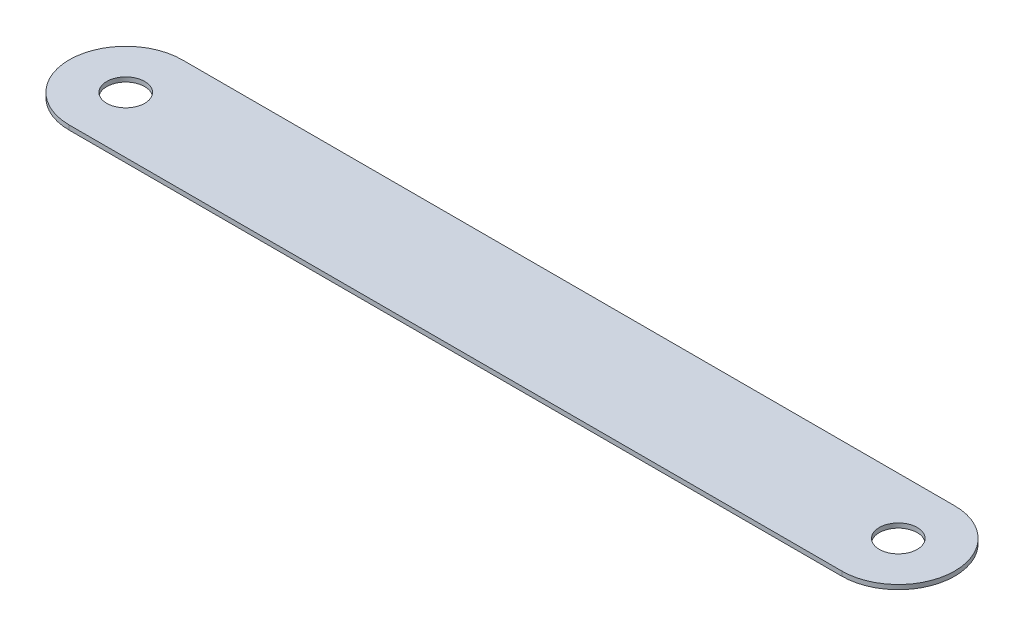
ISO-10303-21;
HEADER;
FILE_DESCRIPTION(('STEP AP214'),'2;1');
FILE_NAME('part.step','',(''),(''),'','','');
FILE_SCHEMA(('AUTOMOTIVE_DESIGN { 1 0 10303 214 1 1 1 1 }'));
ENDSEC;
DATA;
#1=APPLICATION_CONTEXT('core data for automotive mechanical design processes');
#2=APPLICATION_PROTOCOL_DEFINITION('international standard','automotive_design',2000,#1);
#3=PRODUCT_CONTEXT('',#1,'mechanical');
#4=PRODUCT('Part','Part','',(#3));
#5=PRODUCT_RELATED_PRODUCT_CATEGORY('part','',(#4));
#6=PRODUCT_DEFINITION_FORMATION('','',#4);
#7=PRODUCT_DEFINITION_CONTEXT('part definition',#1,'design');
#8=PRODUCT_DEFINITION('design','',#6,#7);
#9=PRODUCT_DEFINITION_SHAPE('','',#8);
#10=(LENGTH_UNIT() NAMED_UNIT(*) SI_UNIT(.MILLI.,.METRE.));
#11=(NAMED_UNIT(*) PLANE_ANGLE_UNIT() SI_UNIT($,.RADIAN.));
#12=(NAMED_UNIT(*) SI_UNIT($,.STERADIAN.) SOLID_ANGLE_UNIT());
#13=UNCERTAINTY_MEASURE_WITH_UNIT(LENGTH_MEASURE(1.E-05),#10,'distance_accuracy_value','');
#14=(GEOMETRIC_REPRESENTATION_CONTEXT(3) GLOBAL_UNCERTAINTY_ASSIGNED_CONTEXT((#13)) GLOBAL_UNIT_ASSIGNED_CONTEXT((#10,
#11,#12)) REPRESENTATION_CONTEXT('',''));
#15=CARTESIAN_POINT('',(0.,0.,0.));
#16=DIRECTION('',(0.,0.,1.));
#17=DIRECTION('',(1.,0.,0.));
#18=AXIS2_PLACEMENT_3D('',#15,#16,#17);
#19=CARTESIAN_POINT('',(-42.75,0.5,0.));
#20=DIRECTION('',(0.,1.,0.));
#21=DIRECTION('',(0.,0.,1.));
#22=AXIS2_PLACEMENT_3D('',#19,#20,#21);
#23=PLANE('',#22);
#24=CARTESIAN_POINT('',(-42.75,0.5,0.));
#25=DIRECTION('',(0.,1.,0.));
#26=DIRECTION('',(0.,0.,1.));
#27=AXIS2_PLACEMENT_3D('',#24,#25,#26);
#28=CIRCLE('',#27,2.1);
#29=CARTESIAN_POINT('',(-42.75,0.5,2.1));
#30=VERTEX_POINT('',#29);
#31=EDGE_CURVE('E106',#30,#30,#28,.T.);
#32=ORIENTED_EDGE('',*,*,#31,.F.);
#33=EDGE_LOOP('',(#32));
#34=FACE_BOUND('',#33,.T.);
#35=CARTESIAN_POINT('',(-42.75,0.5,0.));
#36=DIRECTION('',(0.,1.,0.));
#37=DIRECTION('',(0.,0.,1.));
#38=AXIS2_PLACEMENT_3D('',#35,#36,#37);
#39=CIRCLE('',#38,6.25000000000001);
#40=CARTESIAN_POINT('',(-42.75,0.5,-6.25000000000001));
#41=VERTEX_POINT('',#40);
#42=CARTESIAN_POINT('',(-42.75,0.5,6.25000000000001));
#43=VERTEX_POINT('',#42);
#44=EDGE_CURVE('E91',#41,#43,#39,.T.);
#45=ORIENTED_EDGE('',*,*,#44,.T.);
#46=DIRECTION('',(1.,0.,0.));
#47=VECTOR('',#46,1.);
#48=CARTESIAN_POINT('',(-42.75,0.5,6.25000000000001));
#49=LINE('',#48,#47);
#50=CARTESIAN_POINT('',(42.75,0.5,6.25));
#51=VERTEX_POINT('',#50);
#52=EDGE_CURVE('E86',#43,#51,#49,.T.);
#53=ORIENTED_EDGE('',*,*,#52,.T.);
#54=CARTESIAN_POINT('',(42.75,0.5,0.));
#55=DIRECTION('',(0.,1.,0.));
#56=DIRECTION('',(0.,0.,1.));
#57=AXIS2_PLACEMENT_3D('',#54,#55,#56);
#58=CIRCLE('',#57,6.25000000000001);
#59=CARTESIAN_POINT('',(42.75,0.5,-6.25000000000001));
#60=VERTEX_POINT('',#59);
#61=EDGE_CURVE('E89',#51,#60,#58,.T.);
#62=ORIENTED_EDGE('',*,*,#61,.T.);
#63=DIRECTION('',(-1.,0.,0.));
#64=VECTOR('',#63,1.);
#65=CARTESIAN_POINT('',(-42.75,0.5,-6.25000000000001));
#66=LINE('',#65,#64);
#67=EDGE_CURVE('E56',#60,#41,#66,.T.);
#68=ORIENTED_EDGE('',*,*,#67,.T.);
#69=EDGE_LOOP('',(#45,#53,#62,#68));
#70=FACE_BOUND('',#69,.T.);
#71=CARTESIAN_POINT('',(42.75,0.5,0.));
#72=DIRECTION('',(0.,1.,0.));
#73=DIRECTION('',(0.,0.,1.));
#74=AXIS2_PLACEMENT_3D('',#71,#72,#73);
#75=CIRCLE('',#74,2.1);
#76=CARTESIAN_POINT('',(42.75,0.5,2.09999999999999));
#77=VERTEX_POINT('',#76);
#78=EDGE_CURVE('E121',#77,#77,#75,.T.);
#79=ORIENTED_EDGE('',*,*,#78,.F.);
#80=EDGE_LOOP('',(#79));
#81=FACE_BOUND('',#80,.T.);
#82=ADVANCED_FACE('F39',(#34,#70,#81),#23,.T.);
#83=CARTESIAN_POINT('',(-42.75,0.,0.));
#84=DIRECTION('',(0.,1.,0.));
#85=DIRECTION('',(0.,0.,1.));
#86=AXIS2_PLACEMENT_3D('',#83,#84,#85);
#87=PLANE('',#86);
#88=CARTESIAN_POINT('',(-42.75,0.,0.));
#89=DIRECTION('',(0.,1.,0.));
#90=DIRECTION('',(0.,0.,1.));
#91=AXIS2_PLACEMENT_3D('',#88,#89,#90);
#92=CIRCLE('',#91,6.25000000000001);
#93=CARTESIAN_POINT('',(-42.75,0.,-6.25000000000001));
#94=VERTEX_POINT('',#93);
#95=CARTESIAN_POINT('',(-42.75,0.,6.25000000000001));
#96=VERTEX_POINT('',#95);
#97=EDGE_CURVE('E103',#94,#96,#92,.T.);
#98=ORIENTED_EDGE('',*,*,#97,.F.);
#99=DIRECTION('',(-1.,0.,0.));
#100=VECTOR('',#99,1.);
#101=CARTESIAN_POINT('',(-42.75,0.,-6.25000000000001));
#102=LINE('',#101,#100);
#103=CARTESIAN_POINT('',(42.75,0.,-6.25000000000001));
#104=VERTEX_POINT('',#103);
#105=EDGE_CURVE('E79',#104,#94,#102,.T.);
#106=ORIENTED_EDGE('',*,*,#105,.F.);
#107=CARTESIAN_POINT('',(42.75,0.,0.));
#108=DIRECTION('',(0.,1.,0.));
#109=DIRECTION('',(0.,0.,1.));
#110=AXIS2_PLACEMENT_3D('',#107,#108,#109);
#111=CIRCLE('',#110,6.25000000000001);
#112=CARTESIAN_POINT('',(42.75,0.,6.25));
#113=VERTEX_POINT('',#112);
#114=EDGE_CURVE('E73',#113,#104,#111,.T.);
#115=ORIENTED_EDGE('',*,*,#114,.F.);
#116=DIRECTION('',(1.,0.,0.));
#117=VECTOR('',#116,1.);
#118=CARTESIAN_POINT('',(-42.75,0.,6.25000000000001));
#119=LINE('',#118,#117);
#120=EDGE_CURVE('E95',#96,#113,#119,.T.);
#121=ORIENTED_EDGE('',*,*,#120,.F.);
#122=EDGE_LOOP('',(#98,#106,#115,#121));
#123=FACE_BOUND('',#122,.T.);
#124=CARTESIAN_POINT('',(-42.75,0.,0.));
#125=DIRECTION('',(0.,1.,0.));
#126=DIRECTION('',(0.,0.,1.));
#127=AXIS2_PLACEMENT_3D('',#124,#125,#126);
#128=CIRCLE('',#127,2.1);
#129=CARTESIAN_POINT('',(-42.75,0.,2.1));
#130=VERTEX_POINT('',#129);
#131=EDGE_CURVE('E118',#130,#130,#128,.T.);
#132=ORIENTED_EDGE('',*,*,#131,.T.);
#133=EDGE_LOOP('',(#132));
#134=FACE_BOUND('',#133,.T.);
#135=CARTESIAN_POINT('',(42.75,0.,0.));
#136=DIRECTION('',(0.,1.,0.));
#137=DIRECTION('',(0.,0.,1.));
#138=AXIS2_PLACEMENT_3D('',#135,#136,#137);
#139=CIRCLE('',#138,2.1);
#140=CARTESIAN_POINT('',(42.75,0.,2.09999999999999));
#141=VERTEX_POINT('',#140);
#142=EDGE_CURVE('E124',#141,#141,#139,.T.);
#143=ORIENTED_EDGE('',*,*,#142,.T.);
#144=EDGE_LOOP('',(#143));
#145=FACE_BOUND('',#144,.T.);
#146=ADVANCED_FACE('F114',(#123,#134,#145),#87,.F.);
#147=CARTESIAN_POINT('',(-42.75,0.5,0.));
#148=DIRECTION('',(0.,-1.,0.));
#149=DIRECTION('',(0.,0.,-1.));
#150=AXIS2_PLACEMENT_3D('',#147,#148,#149);
#151=CYLINDRICAL_SURFACE('',#150,6.25000000000001);
#152=ORIENTED_EDGE('',*,*,#97,.T.);
#153=DIRECTION('',(0.,-1.,0.));
#154=VECTOR('',#153,1.);
#155=CARTESIAN_POINT('',(-42.75,0.5,6.25000000000001));
#156=LINE('',#155,#154);
#157=EDGE_CURVE('E11',#43,#96,#156,.T.);
#158=ORIENTED_EDGE('',*,*,#157,.F.);
#159=ORIENTED_EDGE('',*,*,#44,.F.);
#160=DIRECTION('',(0.,-1.,0.));
#161=VECTOR('',#160,1.);
#162=CARTESIAN_POINT('',(-42.75,0.5,-6.25000000000001));
#163=LINE('',#162,#161);
#164=EDGE_CURVE('E99',#41,#94,#163,.T.);
#165=ORIENTED_EDGE('',*,*,#164,.T.);
#166=EDGE_LOOP('',(#152,#158,#159,#165));
#167=FACE_BOUND('',#166,.T.);
#168=ADVANCED_FACE('F41',(#167),#151,.T.);
#169=CARTESIAN_POINT('',(-42.75,0.5,6.25000000000001));
#170=DIRECTION('',(0.,0.,-1.));
#171=DIRECTION('',(-1.,0.,0.));
#172=AXIS2_PLACEMENT_3D('',#169,#170,#171);
#173=PLANE('',#172);
#174=ORIENTED_EDGE('',*,*,#120,.T.);
#175=DIRECTION('',(0.,-1.,0.));
#176=VECTOR('',#175,1.);
#177=CARTESIAN_POINT('',(42.75,0.5,6.25));
#178=LINE('',#177,#176);
#179=EDGE_CURVE('E48',#51,#113,#178,.T.);
#180=ORIENTED_EDGE('',*,*,#179,.F.);
#181=ORIENTED_EDGE('',*,*,#52,.F.);
#182=ORIENTED_EDGE('',*,*,#157,.T.);
#183=EDGE_LOOP('',(#174,#180,#181,#182));
#184=FACE_BOUND('',#183,.T.);
#185=ADVANCED_FACE('F94',(#184),#173,.F.);
#186=CARTESIAN_POINT('',(42.75,0.5,0.));
#187=DIRECTION('',(0.,-1.,0.));
#188=DIRECTION('',(0.,0.,-1.));
#189=AXIS2_PLACEMENT_3D('',#186,#187,#188);
#190=CYLINDRICAL_SURFACE('',#189,6.25000000000001);
#191=ORIENTED_EDGE('',*,*,#114,.T.);
#192=DIRECTION('',(0.,-1.,0.));
#193=VECTOR('',#192,1.);
#194=CARTESIAN_POINT('',(42.75,0.5,-6.25000000000001));
#195=LINE('',#194,#193);
#196=EDGE_CURVE('E96',#60,#104,#195,.T.);
#197=ORIENTED_EDGE('',*,*,#196,.F.);
#198=ORIENTED_EDGE('',*,*,#61,.F.);
#199=ORIENTED_EDGE('',*,*,#179,.T.);
#200=EDGE_LOOP('',(#191,#197,#198,#199));
#201=FACE_BOUND('',#200,.T.);
#202=ADVANCED_FACE('F97',(#201),#190,.T.);
#203=CARTESIAN_POINT('',(-42.75,0.5,-6.25000000000001));
#204=DIRECTION('',(0.,0.,1.));
#205=DIRECTION('',(1.,0.,0.));
#206=AXIS2_PLACEMENT_3D('',#203,#204,#205);
#207=PLANE('',#206);
#208=ORIENTED_EDGE('',*,*,#105,.T.);
#209=ORIENTED_EDGE('',*,*,#164,.F.);
#210=ORIENTED_EDGE('',*,*,#67,.F.);
#211=ORIENTED_EDGE('',*,*,#196,.T.);
#212=EDGE_LOOP('',(#208,#209,#210,#211));
#213=FACE_BOUND('',#212,.T.);
#214=ADVANCED_FACE('F111',(#213),#207,.F.);
#215=CARTESIAN_POINT('',(-42.75,0.5,0.));
#216=DIRECTION('',(0.,-1.,0.));
#217=DIRECTION('',(0.,0.,-1.));
#218=AXIS2_PLACEMENT_3D('',#215,#216,#217);
#219=CYLINDRICAL_SURFACE('',#218,2.1);
#220=ORIENTED_EDGE('',*,*,#31,.T.);
#221=EDGE_LOOP('',(#220));
#222=FACE_BOUND('',#221,.T.);
#223=ORIENTED_EDGE('',*,*,#131,.F.);
#224=EDGE_LOOP('',(#223));
#225=FACE_BOUND('',#224,.T.);
#226=ADVANCED_FACE('F141',(#222,#225),#219,.F.);
#227=CARTESIAN_POINT('',(42.75,0.5,0.));
#228=DIRECTION('',(0.,-1.,0.));
#229=DIRECTION('',(0.,0.,-1.));
#230=AXIS2_PLACEMENT_3D('',#227,#228,#229);
#231=CYLINDRICAL_SURFACE('',#230,2.1);
#232=ORIENTED_EDGE('',*,*,#78,.T.);
#233=EDGE_LOOP('',(#232));
#234=FACE_BOUND('',#233,.T.);
#235=ORIENTED_EDGE('',*,*,#142,.F.);
#236=EDGE_LOOP('',(#235));
#237=FACE_BOUND('',#236,.T.);
#238=ADVANCED_FACE('F130',(#234,#237),#231,.F.);
#239=CLOSED_SHELL('',(#82,#146,#168,#185,#202,#214,#226,#238));
#240=MANIFOLD_SOLID_BREP('B2',#239);
#241=ADVANCED_BREP_SHAPE_REPRESENTATION('',(#18,#240),#14);
#242=SHAPE_DEFINITION_REPRESENTATION(#9,#241);
ENDSEC;
END-ISO-10303-21;
